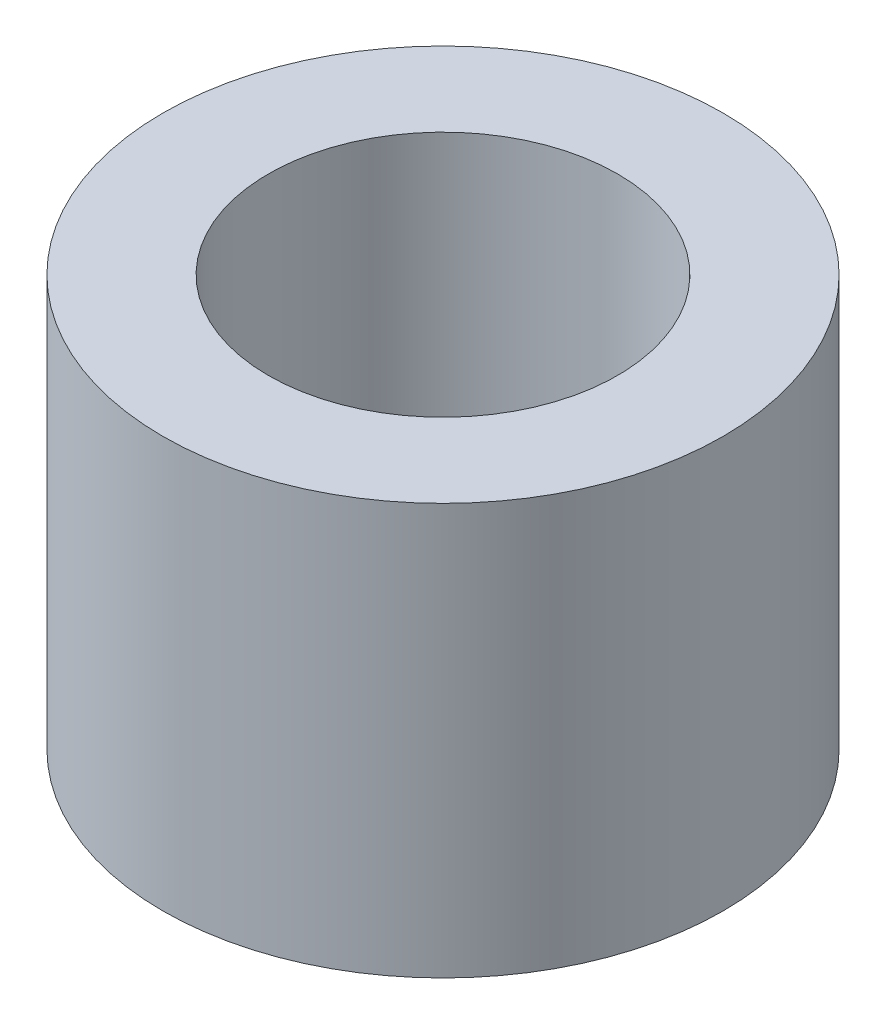
ISO-10303-21;
HEADER;
FILE_DESCRIPTION(('STEP AP214'),'2;1');
FILE_NAME('part.step','',(''),(''),'','','');
FILE_SCHEMA(('AUTOMOTIVE_DESIGN { 1 0 10303 214 1 1 1 1 }'));
ENDSEC;
DATA;
#1=APPLICATION_CONTEXT('core data for automotive mechanical design processes');
#2=APPLICATION_PROTOCOL_DEFINITION('international standard','automotive_design',2000,#1);
#3=PRODUCT_CONTEXT('',#1,'mechanical');
#4=PRODUCT('Part','Part','',(#3));
#5=PRODUCT_RELATED_PRODUCT_CATEGORY('part','',(#4));
#6=PRODUCT_DEFINITION_FORMATION('','',#4);
#7=PRODUCT_DEFINITION_CONTEXT('part definition',#1,'design');
#8=PRODUCT_DEFINITION('design','',#6,#7);
#9=PRODUCT_DEFINITION_SHAPE('','',#8);
#10=(LENGTH_UNIT() NAMED_UNIT(*) SI_UNIT(.MILLI.,.METRE.));
#11=(NAMED_UNIT(*) PLANE_ANGLE_UNIT() SI_UNIT($,.RADIAN.));
#12=(NAMED_UNIT(*) SI_UNIT($,.STERADIAN.) SOLID_ANGLE_UNIT());
#13=UNCERTAINTY_MEASURE_WITH_UNIT(LENGTH_MEASURE(1.E-05),#10,'distance_accuracy_value','');
#14=(GEOMETRIC_REPRESENTATION_CONTEXT(3) GLOBAL_UNCERTAINTY_ASSIGNED_CONTEXT((#13)) GLOBAL_UNIT_ASSIGNED_CONTEXT((#10,
#11,#12)) REPRESENTATION_CONTEXT('',''));
#15=CARTESIAN_POINT('',(0.,0.,0.));
#16=DIRECTION('',(0.,0.,1.));
#17=DIRECTION('',(1.,0.,0.));
#18=AXIS2_PLACEMENT_3D('',#15,#16,#17);
#19=CARTESIAN_POINT('',(0.,33.56864,0.));
#20=DIRECTION('',(0.,1.,0.));
#21=DIRECTION('',(0.,0.,1.));
#22=AXIS2_PLACEMENT_3D('',#19,#20,#21);
#23=CYLINDRICAL_SURFACE('',#22,18.3642);
#24=CARTESIAN_POINT('',(0.,4.0894,0.));
#25=DIRECTION('',(0.,1.,0.));
#26=DIRECTION('',(0.,0.,1.));
#27=AXIS2_PLACEMENT_3D('',#24,#25,#26);
#28=CIRCLE('',#27,18.3642);
#29=CARTESIAN_POINT('',(0.,4.0894,18.3642));
#30=VERTEX_POINT('',#29);
#31=EDGE_CURVE('E11',#30,#30,#28,.T.);
#32=ORIENTED_EDGE('',*,*,#31,.T.);
#33=EDGE_LOOP('',(#32));
#34=FACE_BOUND('',#33,.T.);
#35=CARTESIAN_POINT('',(0.,31.0388,0.));
#36=DIRECTION('',(0.,1.,0.));
#37=DIRECTION('',(0.,0.,1.));
#38=AXIS2_PLACEMENT_3D('',#35,#36,#37);
#39=CIRCLE('',#38,18.3642);
#40=CARTESIAN_POINT('',(0.,31.0388,18.3642));
#41=VERTEX_POINT('',#40);
#42=EDGE_CURVE('E60',#41,#41,#39,.T.);
#43=ORIENTED_EDGE('',*,*,#42,.F.);
#44=EDGE_LOOP('',(#43));
#45=FACE_BOUND('',#44,.T.);
#46=ADVANCED_FACE('F42',(#34,#45),#23,.T.);
#47=CARTESIAN_POINT('',(-18.3642,4.0894,0.));
#48=DIRECTION('',(0.,-1.,0.));
#49=DIRECTION('',(0.,0.,-1.));
#50=AXIS2_PLACEMENT_3D('',#47,#48,#49);
#51=PLANE('',#50);
#52=CARTESIAN_POINT('',(0.,4.0894,0.));
#53=DIRECTION('',(0.,1.,0.));
#54=DIRECTION('',(0.,0.,1.));
#55=AXIS2_PLACEMENT_3D('',#52,#53,#54);
#56=CIRCLE('',#55,11.4484895098582);
#57=CARTESIAN_POINT('',(0.,4.0894,11.4484895098582));
#58=VERTEX_POINT('',#57);
#59=EDGE_CURVE('E49',#58,#58,#56,.T.);
#60=ORIENTED_EDGE('',*,*,#59,.T.);
#61=EDGE_LOOP('',(#60));
#62=FACE_BOUND('',#61,.T.);
#63=ORIENTED_EDGE('',*,*,#31,.F.);
#64=EDGE_LOOP('',(#63));
#65=FACE_BOUND('',#64,.T.);
#66=ADVANCED_FACE('F70',(#62,#65),#51,.T.);
#67=CARTESIAN_POINT('',(0.,33.56864,0.));
#68=DIRECTION('',(0.,1.,0.));
#69=DIRECTION('',(0.,0.,1.));
#70=AXIS2_PLACEMENT_3D('',#67,#68,#69);
#71=CYLINDRICAL_SURFACE('',#70,11.4484895098582);
#72=CARTESIAN_POINT('',(0.,31.0388,0.));
#73=DIRECTION('',(0.,1.,0.));
#74=DIRECTION('',(0.,0.,1.));
#75=AXIS2_PLACEMENT_3D('',#72,#73,#74);
#76=CIRCLE('',#75,11.4484895098582);
#77=CARTESIAN_POINT('',(0.,31.0388,11.4484895098582));
#78=VERTEX_POINT('',#77);
#79=EDGE_CURVE('E55',#78,#78,#76,.T.);
#80=ORIENTED_EDGE('',*,*,#79,.T.);
#81=EDGE_LOOP('',(#80));
#82=FACE_BOUND('',#81,.T.);
#83=ORIENTED_EDGE('',*,*,#59,.F.);
#84=EDGE_LOOP('',(#83));
#85=FACE_BOUND('',#84,.T.);
#86=ADVANCED_FACE('F74',(#82,#85),#71,.F.);
#87=CARTESIAN_POINT('',(-18.3642,31.0388,0.));
#88=DIRECTION('',(0.,1.,0.));
#89=DIRECTION('',(0.,0.,1.));
#90=AXIS2_PLACEMENT_3D('',#87,#88,#89);
#91=PLANE('',#90);
#92=ORIENTED_EDGE('',*,*,#42,.T.);
#93=EDGE_LOOP('',(#92));
#94=FACE_BOUND('',#93,.T.);
#95=ORIENTED_EDGE('',*,*,#79,.F.);
#96=EDGE_LOOP('',(#95));
#97=FACE_BOUND('',#96,.T.);
#98=ADVANCED_FACE('F66',(#94,#97),#91,.T.);
#99=CLOSED_SHELL('',(#46,#66,#86,#98));
#100=MANIFOLD_SOLID_BREP('B2',#99);
#101=ADVANCED_BREP_SHAPE_REPRESENTATION('',(#18,#100),#14);
#102=SHAPE_DEFINITION_REPRESENTATION(#9,#101);
ENDSEC;
END-ISO-10303-21;
